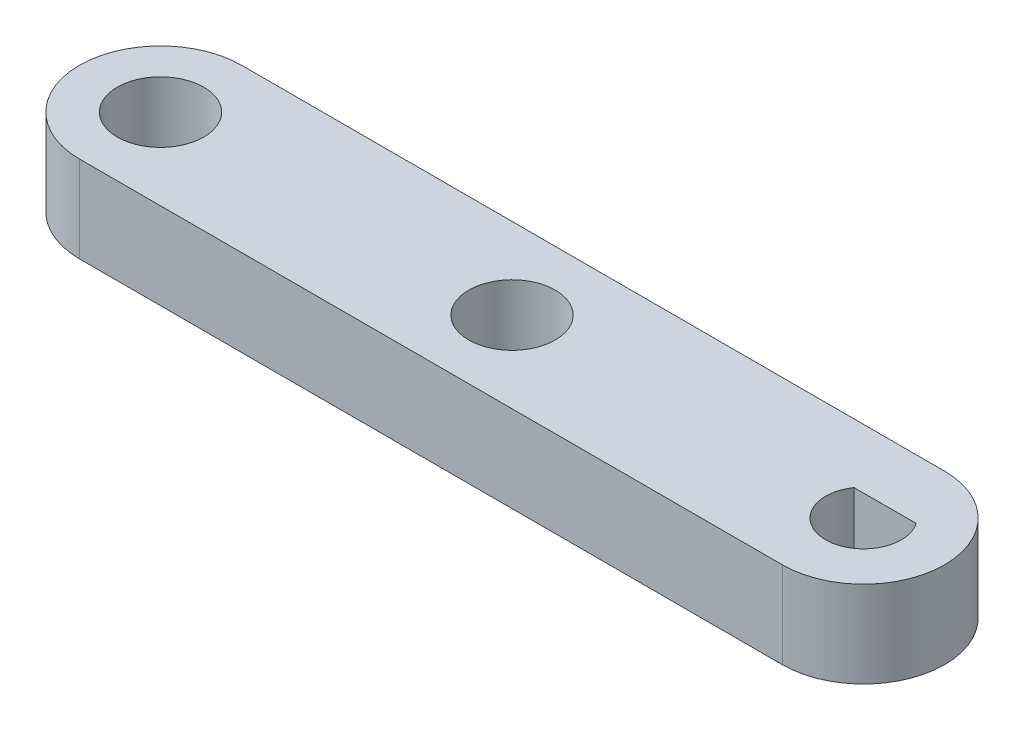
ISO-10303-21;
HEADER;
FILE_DESCRIPTION(('STEP AP214'),'2;1');
FILE_NAME('part.step','',(''),(''),'','','');
FILE_SCHEMA(('AUTOMOTIVE_DESIGN { 1 0 10303 214 1 1 1 1 }'));
ENDSEC;
DATA;
#1=APPLICATION_CONTEXT('core data for automotive mechanical design processes');
#2=APPLICATION_PROTOCOL_DEFINITION('international standard','automotive_design',2000,#1);
#3=PRODUCT_CONTEXT('',#1,'mechanical');
#4=PRODUCT('Part','Part','',(#3));
#5=PRODUCT_RELATED_PRODUCT_CATEGORY('part','',(#4));
#6=PRODUCT_DEFINITION_FORMATION('','',#4);
#7=PRODUCT_DEFINITION_CONTEXT('part definition',#1,'design');
#8=PRODUCT_DEFINITION('design','',#6,#7);
#9=PRODUCT_DEFINITION_SHAPE('','',#8);
#10=(LENGTH_UNIT() NAMED_UNIT(*) SI_UNIT(.MILLI.,.METRE.));
#11=(NAMED_UNIT(*) PLANE_ANGLE_UNIT() SI_UNIT($,.RADIAN.));
#12=(NAMED_UNIT(*) SI_UNIT($,.STERADIAN.) SOLID_ANGLE_UNIT());
#13=UNCERTAINTY_MEASURE_WITH_UNIT(LENGTH_MEASURE(1.E-05),#10,'distance_accuracy_value','');
#14=(GEOMETRIC_REPRESENTATION_CONTEXT(3) GLOBAL_UNCERTAINTY_ASSIGNED_CONTEXT((#13)) GLOBAL_UNIT_ASSIGNED_CONTEXT((#10,
#11,#12)) REPRESENTATION_CONTEXT('',''));
#15=CARTESIAN_POINT('',(0.,0.,0.));
#16=DIRECTION('',(0.,0.,1.));
#17=DIRECTION('',(1.,0.,0.));
#18=AXIS2_PLACEMENT_3D('',#15,#16,#17);
#19=CARTESIAN_POINT('',(0.,4.,0.));
#20=DIRECTION('',(0.,1.,0.));
#21=DIRECTION('',(0.,0.,1.));
#22=AXIS2_PLACEMENT_3D('',#19,#20,#21);
#23=PLANE('',#22);
#24=CARTESIAN_POINT('',(0.,4.,0.));
#25=DIRECTION('',(0.,1.,0.));
#26=DIRECTION('',(0.,0.,1.));
#27=AXIS2_PLACEMENT_3D('',#24,#25,#26);
#28=CIRCLE('',#27,2.);
#29=CARTESIAN_POINT('',(0.,4.,2.));
#30=VERTEX_POINT('',#29);
#31=EDGE_CURVE('E123',#30,#30,#28,.T.);
#32=ORIENTED_EDGE('',*,*,#31,.F.);
#33=EDGE_LOOP('',(#32));
#34=FACE_BOUND('',#33,.T.);
#35=CARTESIAN_POINT('',(0.,4.,0.));
#36=DIRECTION('',(0.,1.,0.));
#37=DIRECTION('',(0.,0.,1.));
#38=AXIS2_PLACEMENT_3D('',#35,#36,#37);
#39=CIRCLE('',#38,3.75);
#40=CARTESIAN_POINT('',(0.,4.,-3.75));
#41=VERTEX_POINT('',#40);
#42=CARTESIAN_POINT('',(0.,4.,3.75));
#43=VERTEX_POINT('',#42);
#44=EDGE_CURVE('E131',#41,#43,#39,.T.);
#45=ORIENTED_EDGE('',*,*,#44,.T.);
#46=DIRECTION('',(1.,0.,0.));
#47=VECTOR('',#46,1.);
#48=CARTESIAN_POINT('',(0.,4.,3.75));
#49=LINE('',#48,#47);
#50=CARTESIAN_POINT('',(32.5,4.,3.75));
#51=VERTEX_POINT('',#50);
#52=EDGE_CURVE('E135',#43,#51,#49,.T.);
#53=ORIENTED_EDGE('',*,*,#52,.T.);
#54=CARTESIAN_POINT('',(32.5,4.,0.));
#55=DIRECTION('',(0.,1.,0.));
#56=DIRECTION('',(0.,0.,1.));
#57=AXIS2_PLACEMENT_3D('',#54,#55,#56);
#58=CIRCLE('',#57,3.75);
#59=CARTESIAN_POINT('',(32.5,4.,-3.75));
#60=VERTEX_POINT('',#59);
#61=EDGE_CURVE('E139',#51,#60,#58,.T.);
#62=ORIENTED_EDGE('',*,*,#61,.T.);
#63=DIRECTION('',(-1.,0.,0.));
#64=VECTOR('',#63,1.);
#65=CARTESIAN_POINT('',(0.,4.,-3.75));
#66=LINE('',#65,#64);
#67=EDGE_CURVE('E142',#60,#41,#66,.T.);
#68=ORIENTED_EDGE('',*,*,#67,.T.);
#69=EDGE_LOOP('',(#45,#53,#62,#68));
#70=FACE_BOUND('',#69,.T.);
#71=CARTESIAN_POINT('',(16.25,4.,0.));
#72=DIRECTION('',(0.,1.,0.));
#73=DIRECTION('',(0.,0.,1.));
#74=AXIS2_PLACEMENT_3D('',#71,#72,#73);
#75=CIRCLE('',#74,2.);
#76=CARTESIAN_POINT('',(16.25,4.,2.));
#77=VERTEX_POINT('',#76);
#78=EDGE_CURVE('E115',#77,#77,#75,.T.);
#79=ORIENTED_EDGE('',*,*,#78,.F.);
#80=EDGE_LOOP('',(#79));
#81=FACE_BOUND('',#80,.T.);
#82=DIRECTION('',(-1.,0.,0.));
#83=VECTOR('',#82,1.);
#84=CARTESIAN_POINT('',(31.0638593383655,4.,-1.));
#85=LINE('',#84,#83);
#86=CARTESIAN_POINT('',(33.9361406616345,4.,-1.));
#87=VERTEX_POINT('',#86);
#88=CARTESIAN_POINT('',(31.0638593383655,4.,-1.));
#89=VERTEX_POINT('',#88);
#90=EDGE_CURVE('E92',#87,#89,#85,.T.);
#91=ORIENTED_EDGE('',*,*,#90,.F.);
#92=CARTESIAN_POINT('',(32.5,4.,0.));
#93=DIRECTION('',(0.,1.,0.));
#94=DIRECTION('',(0.,0.,1.));
#95=AXIS2_PLACEMENT_3D('',#92,#93,#94);
#96=CIRCLE('',#95,1.75);
#97=EDGE_CURVE('E99',#89,#87,#96,.T.);
#98=ORIENTED_EDGE('',*,*,#97,.F.);
#99=EDGE_LOOP('',(#91,#98));
#100=FACE_BOUND('',#99,.T.);
#101=ADVANCED_FACE('F39',(#34,#70,#81,#100),#23,.T.);
#102=CARTESIAN_POINT('',(0.,0.,0.));
#103=DIRECTION('',(0.,1.,0.));
#104=DIRECTION('',(0.,0.,1.));
#105=AXIS2_PLACEMENT_3D('',#102,#103,#104);
#106=PLANE('',#105);
#107=CARTESIAN_POINT('',(16.25,0.,0.));
#108=DIRECTION('',(0.,1.,0.));
#109=DIRECTION('',(0.,0.,1.));
#110=AXIS2_PLACEMENT_3D('',#107,#108,#109);
#111=CIRCLE('',#110,2.);
#112=CARTESIAN_POINT('',(16.25,0.,2.));
#113=VERTEX_POINT('',#112);
#114=EDGE_CURVE('E114',#113,#113,#111,.T.);
#115=ORIENTED_EDGE('',*,*,#114,.T.);
#116=EDGE_LOOP('',(#115));
#117=FACE_BOUND('',#116,.T.);
#118=CARTESIAN_POINT('',(0.,0.,0.));
#119=DIRECTION('',(0.,1.,0.));
#120=DIRECTION('',(0.,0.,1.));
#121=AXIS2_PLACEMENT_3D('',#118,#119,#120);
#122=CIRCLE('',#121,2.);
#123=CARTESIAN_POINT('',(0.,0.,2.));
#124=VERTEX_POINT('',#123);
#125=EDGE_CURVE('E119',#124,#124,#122,.T.);
#126=ORIENTED_EDGE('',*,*,#125,.T.);
#127=EDGE_LOOP('',(#126));
#128=FACE_BOUND('',#127,.T.);
#129=CARTESIAN_POINT('',(0.,0.,0.));
#130=DIRECTION('',(0.,1.,0.));
#131=DIRECTION('',(0.,0.,1.));
#132=AXIS2_PLACEMENT_3D('',#129,#130,#131);
#133=CIRCLE('',#132,3.75);
#134=CARTESIAN_POINT('',(0.,0.,-3.75));
#135=VERTEX_POINT('',#134);
#136=CARTESIAN_POINT('',(0.,0.,3.75));
#137=VERTEX_POINT('',#136);
#138=EDGE_CURVE('E127',#135,#137,#133,.T.);
#139=ORIENTED_EDGE('',*,*,#138,.F.);
#140=DIRECTION('',(-1.,0.,0.));
#141=VECTOR('',#140,1.);
#142=CARTESIAN_POINT('',(0.,0.,-3.75));
#143=LINE('',#142,#141);
#144=CARTESIAN_POINT('',(32.5,0.,-3.75));
#145=VERTEX_POINT('',#144);
#146=EDGE_CURVE('E136',#145,#135,#143,.T.);
#147=ORIENTED_EDGE('',*,*,#146,.F.);
#148=CARTESIAN_POINT('',(32.5,0.,0.));
#149=DIRECTION('',(0.,1.,0.));
#150=DIRECTION('',(0.,0.,1.));
#151=AXIS2_PLACEMENT_3D('',#148,#149,#150);
#152=CIRCLE('',#151,3.75);
#153=CARTESIAN_POINT('',(32.5,0.,3.75));
#154=VERTEX_POINT('',#153);
#155=EDGE_CURVE('E152',#154,#145,#152,.T.);
#156=ORIENTED_EDGE('',*,*,#155,.F.);
#157=DIRECTION('',(1.,0.,0.));
#158=VECTOR('',#157,1.);
#159=CARTESIAN_POINT('',(0.,0.,3.75));
#160=LINE('',#159,#158);
#161=EDGE_CURVE('E149',#137,#154,#160,.T.);
#162=ORIENTED_EDGE('',*,*,#161,.F.);
#163=EDGE_LOOP('',(#139,#147,#156,#162));
#164=FACE_BOUND('',#163,.T.);
#165=CARTESIAN_POINT('',(32.5,0.,0.));
#166=DIRECTION('',(0.,1.,0.));
#167=DIRECTION('',(0.,0.,1.));
#168=AXIS2_PLACEMENT_3D('',#165,#166,#167);
#169=CIRCLE('',#168,1.75);
#170=CARTESIAN_POINT('',(31.0638593383655,0.,-1.));
#171=VERTEX_POINT('',#170);
#172=CARTESIAN_POINT('',(33.9361406616345,0.,-1.));
#173=VERTEX_POINT('',#172);
#174=EDGE_CURVE('E62',#171,#173,#169,.T.);
#175=ORIENTED_EDGE('',*,*,#174,.T.);
#176=DIRECTION('',(-1.,0.,0.));
#177=VECTOR('',#176,1.);
#178=CARTESIAN_POINT('',(31.0638593383655,0.,-1.));
#179=LINE('',#178,#177);
#180=EDGE_CURVE('E105',#173,#171,#179,.T.);
#181=ORIENTED_EDGE('',*,*,#180,.T.);
#182=EDGE_LOOP('',(#175,#181));
#183=FACE_BOUND('',#182,.T.);
#184=ADVANCED_FACE('F175',(#117,#128,#164,#183),#106,.F.);
#185=CARTESIAN_POINT('',(0.,4.,0.));
#186=DIRECTION('',(0.,-1.,0.));
#187=DIRECTION('',(0.,0.,-1.));
#188=AXIS2_PLACEMENT_3D('',#185,#186,#187);
#189=CYLINDRICAL_SURFACE('',#188,3.75);
#190=ORIENTED_EDGE('',*,*,#138,.T.);
#191=DIRECTION('',(0.,-1.,0.));
#192=VECTOR('',#191,1.);
#193=CARTESIAN_POINT('',(0.,4.,3.75));
#194=LINE('',#193,#192);
#195=EDGE_CURVE('E11',#43,#137,#194,.T.);
#196=ORIENTED_EDGE('',*,*,#195,.F.);
#197=ORIENTED_EDGE('',*,*,#44,.F.);
#198=DIRECTION('',(0.,-1.,0.));
#199=VECTOR('',#198,1.);
#200=CARTESIAN_POINT('',(0.,4.,-3.75));
#201=LINE('',#200,#199);
#202=EDGE_CURVE('E145',#41,#135,#201,.T.);
#203=ORIENTED_EDGE('',*,*,#202,.T.);
#204=EDGE_LOOP('',(#190,#196,#197,#203));
#205=FACE_BOUND('',#204,.T.);
#206=ADVANCED_FACE('F41',(#205),#189,.T.);
#207=CARTESIAN_POINT('',(0.,4.,3.75));
#208=DIRECTION('',(0.,0.,-1.));
#209=DIRECTION('',(-1.,0.,0.));
#210=AXIS2_PLACEMENT_3D('',#207,#208,#209);
#211=PLANE('',#210);
#212=ORIENTED_EDGE('',*,*,#161,.T.);
#213=DIRECTION('',(0.,-1.,0.));
#214=VECTOR('',#213,1.);
#215=CARTESIAN_POINT('',(32.5,4.,3.75));
#216=LINE('',#215,#214);
#217=EDGE_CURVE('E48',#51,#154,#216,.T.);
#218=ORIENTED_EDGE('',*,*,#217,.F.);
#219=ORIENTED_EDGE('',*,*,#52,.F.);
#220=ORIENTED_EDGE('',*,*,#195,.T.);
#221=EDGE_LOOP('',(#212,#218,#219,#220));
#222=FACE_BOUND('',#221,.T.);
#223=ADVANCED_FACE('F186',(#222),#211,.F.);
#224=CARTESIAN_POINT('',(32.5,4.,0.));
#225=DIRECTION('',(0.,-1.,0.));
#226=DIRECTION('',(0.,0.,-1.));
#227=AXIS2_PLACEMENT_3D('',#224,#225,#226);
#228=CYLINDRICAL_SURFACE('',#227,3.75);
#229=ORIENTED_EDGE('',*,*,#155,.T.);
#230=DIRECTION('',(0.,-1.,0.));
#231=VECTOR('',#230,1.);
#232=CARTESIAN_POINT('',(32.5,4.,-3.75));
#233=LINE('',#232,#231);
#234=EDGE_CURVE('E160',#60,#145,#233,.T.);
#235=ORIENTED_EDGE('',*,*,#234,.F.);
#236=ORIENTED_EDGE('',*,*,#61,.F.);
#237=ORIENTED_EDGE('',*,*,#217,.T.);
#238=EDGE_LOOP('',(#229,#235,#236,#237));
#239=FACE_BOUND('',#238,.T.);
#240=ADVANCED_FACE('F169',(#239),#228,.T.);
#241=CARTESIAN_POINT('',(0.,4.,-3.75));
#242=DIRECTION('',(0.,0.,1.));
#243=DIRECTION('',(1.,0.,0.));
#244=AXIS2_PLACEMENT_3D('',#241,#242,#243);
#245=PLANE('',#244);
#246=ORIENTED_EDGE('',*,*,#146,.T.);
#247=ORIENTED_EDGE('',*,*,#202,.F.);
#248=ORIENTED_EDGE('',*,*,#67,.F.);
#249=ORIENTED_EDGE('',*,*,#234,.T.);
#250=EDGE_LOOP('',(#246,#247,#248,#249));
#251=FACE_BOUND('',#250,.T.);
#252=ADVANCED_FACE('F179',(#251),#245,.F.);
#253=CARTESIAN_POINT('',(0.,4.,0.));
#254=DIRECTION('',(0.,-1.,0.));
#255=DIRECTION('',(0.,0.,-1.));
#256=AXIS2_PLACEMENT_3D('',#253,#254,#255);
#257=CYLINDRICAL_SURFACE('',#256,2.);
#258=ORIENTED_EDGE('',*,*,#31,.T.);
#259=EDGE_LOOP('',(#258));
#260=FACE_BOUND('',#259,.T.);
#261=ORIENTED_EDGE('',*,*,#125,.F.);
#262=EDGE_LOOP('',(#261));
#263=FACE_BOUND('',#262,.T.);
#264=ADVANCED_FACE('F203',(#260,#263),#257,.F.);
#265=CARTESIAN_POINT('',(16.25,4.,0.));
#266=DIRECTION('',(0.,-1.,0.));
#267=DIRECTION('',(0.,0.,-1.));
#268=AXIS2_PLACEMENT_3D('',#265,#266,#267);
#269=CYLINDRICAL_SURFACE('',#268,2.);
#270=ORIENTED_EDGE('',*,*,#78,.T.);
#271=EDGE_LOOP('',(#270));
#272=FACE_BOUND('',#271,.T.);
#273=ORIENTED_EDGE('',*,*,#114,.F.);
#274=EDGE_LOOP('',(#273));
#275=FACE_BOUND('',#274,.T.);
#276=ADVANCED_FACE('F210',(#272,#275),#269,.F.);
#277=CARTESIAN_POINT('',(32.5,4.,0.));
#278=DIRECTION('',(0.,-1.,0.));
#279=DIRECTION('',(0.,0.,-1.));
#280=AXIS2_PLACEMENT_3D('',#277,#278,#279);
#281=CYLINDRICAL_SURFACE('',#280,1.75);
#282=ORIENTED_EDGE('',*,*,#174,.F.);
#283=DIRECTION('',(0.,-1.,0.));
#284=VECTOR('',#283,1.);
#285=CARTESIAN_POINT('',(31.0638593383655,4.,-1.));
#286=LINE('',#285,#284);
#287=EDGE_CURVE('E94',#89,#171,#286,.T.);
#288=ORIENTED_EDGE('',*,*,#287,.F.);
#289=ORIENTED_EDGE('',*,*,#97,.T.);
#290=DIRECTION('',(0.,-1.,0.));
#291=VECTOR('',#290,1.);
#292=CARTESIAN_POINT('',(33.9361406616345,4.,-1.));
#293=LINE('',#292,#291);
#294=EDGE_CURVE('E55',#87,#173,#293,.T.);
#295=ORIENTED_EDGE('',*,*,#294,.T.);
#296=EDGE_LOOP('',(#282,#288,#289,#295));
#297=FACE_BOUND('',#296,.T.);
#298=ADVANCED_FACE('F101',(#297),#281,.F.);
#299=CARTESIAN_POINT('',(31.0638593383655,4.,-1.));
#300=DIRECTION('',(0.,0.,1.));
#301=DIRECTION('',(1.,0.,0.));
#302=AXIS2_PLACEMENT_3D('',#299,#300,#301);
#303=PLANE('',#302);
#304=ORIENTED_EDGE('',*,*,#180,.F.);
#305=ORIENTED_EDGE('',*,*,#294,.F.);
#306=ORIENTED_EDGE('',*,*,#90,.T.);
#307=ORIENTED_EDGE('',*,*,#287,.T.);
#308=EDGE_LOOP('',(#304,#305,#306,#307));
#309=FACE_BOUND('',#308,.T.);
#310=ADVANCED_FACE('F93',(#309),#303,.T.);
#311=CLOSED_SHELL('',(#101,#184,#206,#223,#240,#252,#264,#276,#298,#310));
#312=MANIFOLD_SOLID_BREP('B2',#311);
#313=ADVANCED_BREP_SHAPE_REPRESENTATION('',(#18,#312),#14);
#314=SHAPE_DEFINITION_REPRESENTATION(#9,#313);
ENDSEC;
END-ISO-10303-21;
